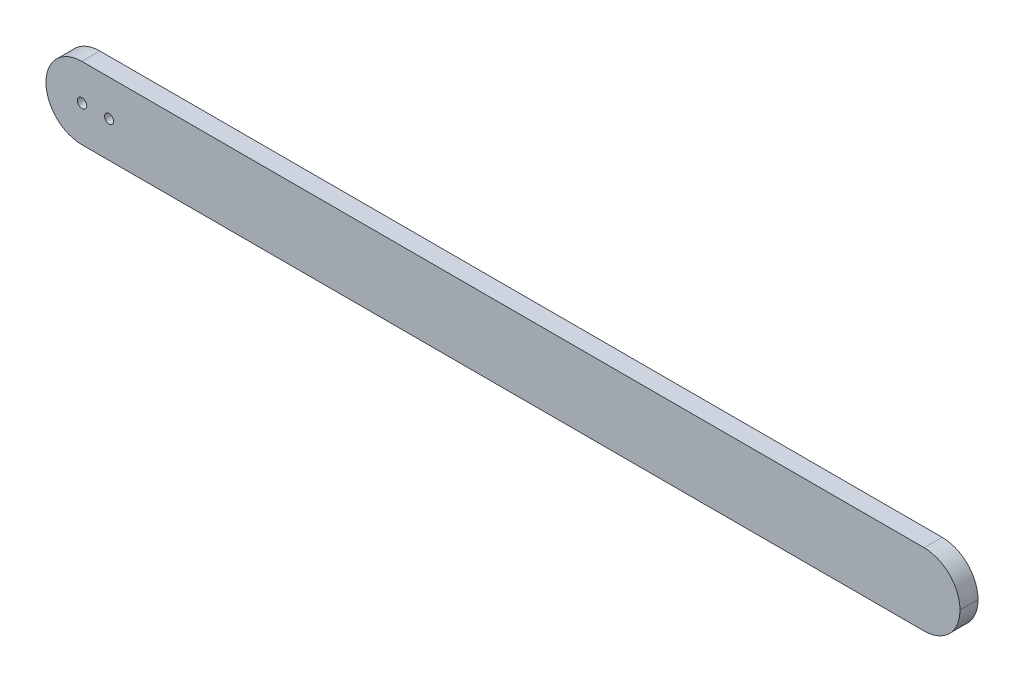
ISO-10303-21;
HEADER;
FILE_DESCRIPTION(('STEP AP214'),'2;1');
FILE_NAME('part.step','',(''),(''),'','','');
FILE_SCHEMA(('AUTOMOTIVE_DESIGN { 1 0 10303 214 1 1 1 1 }'));
ENDSEC;
DATA;
#1=APPLICATION_CONTEXT('core data for automotive mechanical design processes');
#2=APPLICATION_PROTOCOL_DEFINITION('international standard','automotive_design',2000,#1);
#3=PRODUCT_CONTEXT('',#1,'mechanical');
#4=PRODUCT('Part','Part','',(#3));
#5=PRODUCT_RELATED_PRODUCT_CATEGORY('part','',(#4));
#6=PRODUCT_DEFINITION_FORMATION('','',#4);
#7=PRODUCT_DEFINITION_CONTEXT('part definition',#1,'design');
#8=PRODUCT_DEFINITION('design','',#6,#7);
#9=PRODUCT_DEFINITION_SHAPE('','',#8);
#10=(LENGTH_UNIT() NAMED_UNIT(*) SI_UNIT(.MILLI.,.METRE.));
#11=(NAMED_UNIT(*) PLANE_ANGLE_UNIT() SI_UNIT($,.RADIAN.));
#12=(NAMED_UNIT(*) SI_UNIT($,.STERADIAN.) SOLID_ANGLE_UNIT());
#13=UNCERTAINTY_MEASURE_WITH_UNIT(LENGTH_MEASURE(1.E-05),#10,'distance_accuracy_value','');
#14=(GEOMETRIC_REPRESENTATION_CONTEXT(3) GLOBAL_UNCERTAINTY_ASSIGNED_CONTEXT((#13)) GLOBAL_UNIT_ASSIGNED_CONTEXT((#10,
#11,#12)) REPRESENTATION_CONTEXT('',''));
#15=CARTESIAN_POINT('',(0.,0.,0.));
#16=DIRECTION('',(0.,0.,1.));
#17=DIRECTION('',(1.,0.,0.));
#18=AXIS2_PLACEMENT_3D('',#15,#16,#17);
#19=CARTESIAN_POINT('',(927.354,-38.354,0.));
#20=DIRECTION('',(0.,0.,-1.));
#21=DIRECTION('',(-1.,0.,0.));
#22=AXIS2_PLACEMENT_3D('',#19,#20,#21);
#23=PLANE('',#22);
#24=CARTESIAN_POINT('',(38.1,-38.1,0.));
#25=DIRECTION('',(0.,0.,1.));
#26=DIRECTION('',(1.,0.,0.));
#27=AXIS2_PLACEMENT_3D('',#24,#25,#26);
#28=CIRCLE('',#27,4.96093750000001);
#29=CARTESIAN_POINT('',(43.0609375,-38.1,0.));
#30=VERTEX_POINT('',#29);
#31=EDGE_CURVE('E221',#30,#30,#28,.T.);
#32=ORIENTED_EDGE('',*,*,#31,.T.);
#33=EDGE_LOOP('',(#32));
#34=FACE_BOUND('',#33,.T.);
#35=CARTESIAN_POINT('',(603.25,-38.1000000000017,0.));
#36=DIRECTION('',(0.,0.,1.));
#37=DIRECTION('',(1.,0.,0.));
#38=AXIS2_PLACEMENT_3D('',#35,#36,#37);
#39=CIRCLE('',#38,16.66875);
#40=CARTESIAN_POINT('',(619.91875,-38.1000000000017,0.));
#41=VERTEX_POINT('',#40);
#42=EDGE_CURVE('E209',#41,#41,#39,.T.);
#43=ORIENTED_EDGE('',*,*,#42,.T.);
#44=EDGE_LOOP('',(#43));
#45=FACE_BOUND('',#44,.T.);
#46=CARTESIAN_POINT('',(844.55,-38.1,0.));
#47=DIRECTION('',(0.,0.,1.));
#48=DIRECTION('',(1.,0.,0.));
#49=AXIS2_PLACEMENT_3D('',#46,#47,#48);
#50=CIRCLE('',#49,16.66875);
#51=CARTESIAN_POINT('',(861.21875,-38.1,0.));
#52=VERTEX_POINT('',#51);
#53=EDGE_CURVE('E197',#52,#52,#50,.T.);
#54=ORIENTED_EDGE('',*,*,#53,.T.);
#55=EDGE_LOOP('',(#54));
#56=FACE_BOUND('',#55,.T.);
#57=CARTESIAN_POINT('',(241.3,-38.1000000000042,0.));
#58=DIRECTION('',(0.,0.,1.));
#59=DIRECTION('',(1.,0.,0.));
#60=AXIS2_PLACEMENT_3D('',#57,#58,#59);
#61=CIRCLE('',#60,16.66875);
#62=CARTESIAN_POINT('',(257.96875,-38.1000000000042,0.));
#63=VERTEX_POINT('',#62);
#64=EDGE_CURVE('E185',#63,#63,#61,.T.);
#65=ORIENTED_EDGE('',*,*,#64,.T.);
#66=EDGE_LOOP('',(#65));
#67=FACE_BOUND('',#66,.T.);
#68=CARTESIAN_POINT('',(927.354,-38.354,0.));
#69=DIRECTION('',(0.,0.,1.));
#70=DIRECTION('',(-1.,0.,0.));
#71=AXIS2_PLACEMENT_3D('',#68,#69,#70);
#72=CIRCLE('',#71,37.8460000000001);
#73=CARTESIAN_POINT('',(927.354,-76.2,0.));
#74=VERTEX_POINT('',#73);
#75=CARTESIAN_POINT('',(965.2,-38.354,0.));
#76=VERTEX_POINT('',#75);
#77=EDGE_CURVE('E131',#74,#76,#72,.T.);
#78=ORIENTED_EDGE('',*,*,#77,.F.);
#79=DIRECTION('',(1.,0.,0.));
#80=VECTOR('',#79,1.);
#81=CARTESIAN_POINT('',(37.846,-76.2,0.));
#82=LINE('',#81,#80);
#83=CARTESIAN_POINT('',(37.846,-76.2,0.));
#84=VERTEX_POINT('',#83);
#85=EDGE_CURVE('E85',#84,#74,#82,.T.);
#86=ORIENTED_EDGE('',*,*,#85,.F.);
#87=CARTESIAN_POINT('',(37.846,-38.354,0.));
#88=DIRECTION('',(0.,0.,1.));
#89=DIRECTION('',(1.,0.,0.));
#90=AXIS2_PLACEMENT_3D('',#87,#88,#89);
#91=CIRCLE('',#90,37.846);
#92=CARTESIAN_POINT('',(0.,-38.354,0.));
#93=VERTEX_POINT('',#92);
#94=EDGE_CURVE('E79',#93,#84,#91,.T.);
#95=ORIENTED_EDGE('',*,*,#94,.F.);
#96=DIRECTION('',(0.,-1.,0.));
#97=VECTOR('',#96,1.);
#98=CARTESIAN_POINT('',(0.,-37.846,0.));
#99=LINE('',#98,#97);
#100=CARTESIAN_POINT('',(0.,-37.846,0.));
#101=VERTEX_POINT('',#100);
#102=EDGE_CURVE('E121',#101,#93,#99,.T.);
#103=ORIENTED_EDGE('',*,*,#102,.F.);
#104=CARTESIAN_POINT('',(37.846,-37.846,0.));
#105=DIRECTION('',(0.,0.,1.));
#106=DIRECTION('',(-1.,0.,0.));
#107=AXIS2_PLACEMENT_3D('',#104,#105,#106);
#108=CIRCLE('',#107,37.846);
#109=CARTESIAN_POINT('',(37.846,0.,0.));
#110=VERTEX_POINT('',#109);
#111=EDGE_CURVE('E141',#110,#101,#108,.T.);
#112=ORIENTED_EDGE('',*,*,#111,.F.);
#113=DIRECTION('',(-1.,0.,0.));
#114=VECTOR('',#113,1.);
#115=CARTESIAN_POINT('',(37.846,0.,0.));
#116=LINE('',#115,#114);
#117=CARTESIAN_POINT('',(927.354,0.,0.));
#118=VERTEX_POINT('',#117);
#119=EDGE_CURVE('E139',#118,#110,#116,.T.);
#120=ORIENTED_EDGE('',*,*,#119,.F.);
#121=CARTESIAN_POINT('',(927.354,-37.846,0.));
#122=DIRECTION('',(0.,0.,1.));
#123=DIRECTION('',(1.,0.,0.));
#124=AXIS2_PLACEMENT_3D('',#121,#122,#123);
#125=CIRCLE('',#124,37.8460000000001);
#126=CARTESIAN_POINT('',(965.2,-37.846,0.));
#127=VERTEX_POINT('',#126);
#128=EDGE_CURVE('E137',#127,#118,#125,.T.);
#129=ORIENTED_EDGE('',*,*,#128,.F.);
#130=DIRECTION('',(0.,1.,0.));
#131=VECTOR('',#130,1.);
#132=CARTESIAN_POINT('',(965.2,-37.846,0.));
#133=LINE('',#132,#131);
#134=EDGE_CURVE('E134',#76,#127,#133,.T.);
#135=ORIENTED_EDGE('',*,*,#134,.F.);
#136=EDGE_LOOP('',(#78,#86,#95,#103,#112,#120,#129,#135));
#137=FACE_BOUND('',#136,.T.);
#138=CARTESIAN_POINT('',(120.65,-38.1000000000051,0.));
#139=DIRECTION('',(0.,0.,1.));
#140=DIRECTION('',(1.,0.,0.));
#141=AXIS2_PLACEMENT_3D('',#138,#139,#140);
#142=CIRCLE('',#141,16.66875);
#143=CARTESIAN_POINT('',(137.31875,-38.1000000000051,0.));
#144=VERTEX_POINT('',#143);
#145=EDGE_CURVE('E179',#144,#144,#142,.T.);
#146=ORIENTED_EDGE('',*,*,#145,.T.);
#147=EDGE_LOOP('',(#146));
#148=FACE_BOUND('',#147,.T.);
#149=CARTESIAN_POINT('',(361.95,-38.1000000000034,0.));
#150=DIRECTION('',(0.,0.,1.));
#151=DIRECTION('',(1.,0.,0.));
#152=AXIS2_PLACEMENT_3D('',#149,#150,#151);
#153=CIRCLE('',#152,16.66875);
#154=CARTESIAN_POINT('',(378.61875,-38.1000000000034,0.));
#155=VERTEX_POINT('',#154);
#156=EDGE_CURVE('E191',#155,#155,#153,.T.);
#157=ORIENTED_EDGE('',*,*,#156,.T.);
#158=EDGE_LOOP('',(#157));
#159=FACE_BOUND('',#158,.T.);
#160=CARTESIAN_POINT('',(723.9,-38.1000000000008,0.));
#161=DIRECTION('',(0.,0.,1.));
#162=DIRECTION('',(1.,0.,0.));
#163=AXIS2_PLACEMENT_3D('',#160,#161,#162);
#164=CIRCLE('',#163,16.66875);
#165=CARTESIAN_POINT('',(740.56875,-38.1000000000008,0.));
#166=VERTEX_POINT('',#165);
#167=EDGE_CURVE('E203',#166,#166,#164,.T.);
#168=ORIENTED_EDGE('',*,*,#167,.T.);
#169=EDGE_LOOP('',(#168));
#170=FACE_BOUND('',#169,.T.);
#171=CARTESIAN_POINT('',(482.6,-38.1000000000025,0.));
#172=DIRECTION('',(0.,0.,1.));
#173=DIRECTION('',(1.,0.,0.));
#174=AXIS2_PLACEMENT_3D('',#171,#172,#173);
#175=CIRCLE('',#174,16.66875);
#176=CARTESIAN_POINT('',(499.26875,-38.1000000000025,0.));
#177=VERTEX_POINT('',#176);
#178=EDGE_CURVE('E215',#177,#177,#175,.T.);
#179=ORIENTED_EDGE('',*,*,#178,.T.);
#180=EDGE_LOOP('',(#179));
#181=FACE_BOUND('',#180,.T.);
#182=CARTESIAN_POINT('',(66.675,-38.1,0.));
#183=DIRECTION('',(0.,0.,1.));
#184=DIRECTION('',(1.,0.,0.));
#185=AXIS2_PLACEMENT_3D('',#182,#183,#184);
#186=CIRCLE('',#185,4.7625);
#187=CARTESIAN_POINT('',(71.4375,-38.1,0.));
#188=VERTEX_POINT('',#187);
#189=EDGE_CURVE('E227',#188,#188,#186,.T.);
#190=ORIENTED_EDGE('',*,*,#189,.T.);
#191=EDGE_LOOP('',(#190));
#192=FACE_BOUND('',#191,.T.);
#193=ADVANCED_FACE('F33',(#34,#45,#56,#67,#137,#148,#159,#170,#181,#192),#23,.T.);
#194=CARTESIAN_POINT('',(927.354,-38.354,19.05));
#195=DIRECTION('',(0.,0.,-1.));
#196=DIRECTION('',(-1.,0.,0.));
#197=AXIS2_PLACEMENT_3D('',#194,#195,#196);
#198=PLANE('',#197);
#199=CARTESIAN_POINT('',(38.1,-38.1,19.05));
#200=DIRECTION('',(0.,0.,1.));
#201=DIRECTION('',(1.,0.,0.));
#202=AXIS2_PLACEMENT_3D('',#199,#200,#201);
#203=CIRCLE('',#202,4.96093750000001);
#204=CARTESIAN_POINT('',(43.0609375,-38.1,19.05));
#205=VERTEX_POINT('',#204);
#206=EDGE_CURVE('E218',#205,#205,#203,.T.);
#207=ORIENTED_EDGE('',*,*,#206,.F.);
#208=EDGE_LOOP('',(#207));
#209=FACE_BOUND('',#208,.T.);
#210=CARTESIAN_POINT('',(927.354,-38.354,19.05));
#211=DIRECTION('',(0.,0.,1.));
#212=DIRECTION('',(-1.,0.,0.));
#213=AXIS2_PLACEMENT_3D('',#210,#211,#212);
#214=CIRCLE('',#213,37.8460000000001);
#215=CARTESIAN_POINT('',(927.354,-76.2,19.05));
#216=VERTEX_POINT('',#215);
#217=CARTESIAN_POINT('',(965.2,-38.354,19.05));
#218=VERTEX_POINT('',#217);
#219=EDGE_CURVE('E146',#216,#218,#214,.T.);
#220=ORIENTED_EDGE('',*,*,#219,.T.);
#221=DIRECTION('',(0.,1.,0.));
#222=VECTOR('',#221,1.);
#223=CARTESIAN_POINT('',(965.2,-37.846,19.05));
#224=LINE('',#223,#222);
#225=CARTESIAN_POINT('',(965.2,-37.846,19.05));
#226=VERTEX_POINT('',#225);
#227=EDGE_CURVE('E93',#218,#226,#224,.T.);
#228=ORIENTED_EDGE('',*,*,#227,.T.);
#229=CARTESIAN_POINT('',(927.354,-37.846,19.05));
#230=DIRECTION('',(0.,0.,1.));
#231=DIRECTION('',(1.,0.,0.));
#232=AXIS2_PLACEMENT_3D('',#229,#230,#231);
#233=CIRCLE('',#232,37.8460000000001);
#234=CARTESIAN_POINT('',(927.354,0.,19.05));
#235=VERTEX_POINT('',#234);
#236=EDGE_CURVE('E161',#226,#235,#233,.T.);
#237=ORIENTED_EDGE('',*,*,#236,.T.);
#238=DIRECTION('',(-1.,0.,0.));
#239=VECTOR('',#238,1.);
#240=CARTESIAN_POINT('',(37.846,0.,19.05));
#241=LINE('',#240,#239);
#242=CARTESIAN_POINT('',(37.846,0.,19.05));
#243=VERTEX_POINT('',#242);
#244=EDGE_CURVE('E173',#235,#243,#241,.T.);
#245=ORIENTED_EDGE('',*,*,#244,.T.);
#246=CARTESIAN_POINT('',(37.846,-37.846,19.05));
#247=DIRECTION('',(0.,0.,1.));
#248=DIRECTION('',(-1.,0.,0.));
#249=AXIS2_PLACEMENT_3D('',#246,#247,#248);
#250=CIRCLE('',#249,37.846);
#251=CARTESIAN_POINT('',(0.,-37.846,19.05));
#252=VERTEX_POINT('',#251);
#253=EDGE_CURVE('E113',#243,#252,#250,.T.);
#254=ORIENTED_EDGE('',*,*,#253,.T.);
#255=DIRECTION('',(0.,-1.,0.));
#256=VECTOR('',#255,1.);
#257=CARTESIAN_POINT('',(0.,-37.846,19.05));
#258=LINE('',#257,#256);
#259=CARTESIAN_POINT('',(0.,-38.354,19.05));
#260=VERTEX_POINT('',#259);
#261=EDGE_CURVE('E106',#252,#260,#258,.T.);
#262=ORIENTED_EDGE('',*,*,#261,.T.);
#263=CARTESIAN_POINT('',(37.846,-38.354,19.05));
#264=DIRECTION('',(0.,0.,1.));
#265=DIRECTION('',(1.,0.,0.));
#266=AXIS2_PLACEMENT_3D('',#263,#264,#265);
#267=CIRCLE('',#266,37.846);
#268=CARTESIAN_POINT('',(37.846,-76.2,19.05));
#269=VERTEX_POINT('',#268);
#270=EDGE_CURVE('E111',#260,#269,#267,.T.);
#271=ORIENTED_EDGE('',*,*,#270,.T.);
#272=DIRECTION('',(1.,0.,0.));
#273=VECTOR('',#272,1.);
#274=CARTESIAN_POINT('',(37.846,-76.2,19.05));
#275=LINE('',#274,#273);
#276=EDGE_CURVE('E50',#269,#216,#275,.T.);
#277=ORIENTED_EDGE('',*,*,#276,.T.);
#278=EDGE_LOOP('',(#220,#228,#237,#245,#254,#262,#271,#277));
#279=FACE_BOUND('',#278,.T.);
#280=CARTESIAN_POINT('',(66.675,-38.1,19.05));
#281=DIRECTION('',(0.,0.,1.));
#282=DIRECTION('',(1.,0.,0.));
#283=AXIS2_PLACEMENT_3D('',#280,#281,#282);
#284=CIRCLE('',#283,4.7625);
#285=CARTESIAN_POINT('',(71.4375,-38.1,19.05));
#286=VERTEX_POINT('',#285);
#287=EDGE_CURVE('E224',#286,#286,#284,.T.);
#288=ORIENTED_EDGE('',*,*,#287,.F.);
#289=EDGE_LOOP('',(#288));
#290=FACE_BOUND('',#289,.T.);
#291=ADVANCED_FACE('F108',(#209,#279,#290),#198,.F.);
#292=CARTESIAN_POINT('',(927.354,-38.354,19.05));
#293=DIRECTION('',(0.,0.,-1.));
#294=DIRECTION('',(-1.,0.,0.));
#295=AXIS2_PLACEMENT_3D('',#292,#293,#294);
#296=CYLINDRICAL_SURFACE('',#295,37.8460000000001);
#297=ORIENTED_EDGE('',*,*,#77,.T.);
#298=DIRECTION('',(0.,0.,-1.));
#299=VECTOR('',#298,1.);
#300=CARTESIAN_POINT('',(965.2,-38.354,19.05));
#301=LINE('',#300,#299);
#302=EDGE_CURVE('E11',#218,#76,#301,.T.);
#303=ORIENTED_EDGE('',*,*,#302,.F.);
#304=ORIENTED_EDGE('',*,*,#219,.F.);
#305=DIRECTION('',(0.,0.,-1.));
#306=VECTOR('',#305,1.);
#307=CARTESIAN_POINT('',(927.354,-76.2,19.05));
#308=LINE('',#307,#306);
#309=EDGE_CURVE('E127',#216,#74,#308,.T.);
#310=ORIENTED_EDGE('',*,*,#309,.T.);
#311=EDGE_LOOP('',(#297,#303,#304,#310));
#312=FACE_BOUND('',#311,.T.);
#313=ADVANCED_FACE('F35',(#312),#296,.T.);
#314=CARTESIAN_POINT('',(965.2,-37.846,19.05));
#315=DIRECTION('',(-1.,0.,0.));
#316=DIRECTION('',(0.,0.,1.));
#317=AXIS2_PLACEMENT_3D('',#314,#315,#316);
#318=PLANE('',#317);
#319=ORIENTED_EDGE('',*,*,#134,.T.);
#320=DIRECTION('',(0.,0.,-1.));
#321=VECTOR('',#320,1.);
#322=CARTESIAN_POINT('',(965.2,-37.846,19.05));
#323=LINE('',#322,#321);
#324=EDGE_CURVE('E42',#226,#127,#323,.T.);
#325=ORIENTED_EDGE('',*,*,#324,.F.);
#326=ORIENTED_EDGE('',*,*,#227,.F.);
#327=ORIENTED_EDGE('',*,*,#302,.T.);
#328=EDGE_LOOP('',(#319,#325,#326,#327));
#329=FACE_BOUND('',#328,.T.);
#330=ADVANCED_FACE('F242',(#329),#318,.F.);
#331=CARTESIAN_POINT('',(927.354,-37.846,19.05));
#332=DIRECTION('',(0.,0.,-1.));
#333=DIRECTION('',(-1.,0.,0.));
#334=AXIS2_PLACEMENT_3D('',#331,#332,#333);
#335=CYLINDRICAL_SURFACE('',#334,37.8460000000001);
#336=ORIENTED_EDGE('',*,*,#128,.T.);
#337=DIRECTION('',(0.,0.,-1.));
#338=VECTOR('',#337,1.);
#339=CARTESIAN_POINT('',(927.354,0.,19.05));
#340=LINE('',#339,#338);
#341=EDGE_CURVE('E153',#235,#118,#340,.T.);
#342=ORIENTED_EDGE('',*,*,#341,.F.);
#343=ORIENTED_EDGE('',*,*,#236,.F.);
#344=ORIENTED_EDGE('',*,*,#324,.T.);
#345=EDGE_LOOP('',(#336,#342,#343,#344));
#346=FACE_BOUND('',#345,.T.);
#347=ADVANCED_FACE('F159',(#346),#335,.T.);
#348=CARTESIAN_POINT('',(37.846,0.,19.05));
#349=DIRECTION('',(0.,-1.,0.));
#350=DIRECTION('',(0.,0.,-1.));
#351=AXIS2_PLACEMENT_3D('',#348,#349,#350);
#352=PLANE('',#351);
#353=ORIENTED_EDGE('',*,*,#119,.T.);
#354=DIRECTION('',(0.,0.,-1.));
#355=VECTOR('',#354,1.);
#356=CARTESIAN_POINT('',(37.846,0.,19.05));
#357=LINE('',#356,#355);
#358=EDGE_CURVE('E150',#243,#110,#357,.T.);
#359=ORIENTED_EDGE('',*,*,#358,.F.);
#360=ORIENTED_EDGE('',*,*,#244,.F.);
#361=ORIENTED_EDGE('',*,*,#341,.T.);
#362=EDGE_LOOP('',(#353,#359,#360,#361));
#363=FACE_BOUND('',#362,.T.);
#364=ADVANCED_FACE('F169',(#363),#352,.F.);
#365=CARTESIAN_POINT('',(37.846,-37.846,19.05));
#366=DIRECTION('',(0.,0.,-1.));
#367=DIRECTION('',(-1.,0.,0.));
#368=AXIS2_PLACEMENT_3D('',#365,#366,#367);
#369=CYLINDRICAL_SURFACE('',#368,37.846);
#370=ORIENTED_EDGE('',*,*,#111,.T.);
#371=DIRECTION('',(0.,0.,-1.));
#372=VECTOR('',#371,1.);
#373=CARTESIAN_POINT('',(0.,-37.846,19.05));
#374=LINE('',#373,#372);
#375=EDGE_CURVE('E122',#252,#101,#374,.T.);
#376=ORIENTED_EDGE('',*,*,#375,.F.);
#377=ORIENTED_EDGE('',*,*,#253,.F.);
#378=ORIENTED_EDGE('',*,*,#358,.T.);
#379=EDGE_LOOP('',(#370,#376,#377,#378));
#380=FACE_BOUND('',#379,.T.);
#381=ADVANCED_FACE('F172',(#380),#369,.T.);
#382=CARTESIAN_POINT('',(0.,-37.846,19.05));
#383=DIRECTION('',(1.,0.,0.));
#384=DIRECTION('',(0.,0.,-1.));
#385=AXIS2_PLACEMENT_3D('',#382,#383,#384);
#386=PLANE('',#385);
#387=ORIENTED_EDGE('',*,*,#102,.T.);
#388=DIRECTION('',(0.,0.,-1.));
#389=VECTOR('',#388,1.);
#390=CARTESIAN_POINT('',(0.,-38.354,19.05));
#391=LINE('',#390,#389);
#392=EDGE_CURVE('E118',#260,#93,#391,.T.);
#393=ORIENTED_EDGE('',*,*,#392,.F.);
#394=ORIENTED_EDGE('',*,*,#261,.F.);
#395=ORIENTED_EDGE('',*,*,#375,.T.);
#396=EDGE_LOOP('',(#387,#393,#394,#395));
#397=FACE_BOUND('',#396,.T.);
#398=ADVANCED_FACE('F119',(#397),#386,.F.);
#399=CARTESIAN_POINT('',(37.846,-38.354,19.05));
#400=DIRECTION('',(0.,0.,-1.));
#401=DIRECTION('',(-1.,0.,0.));
#402=AXIS2_PLACEMENT_3D('',#399,#400,#401);
#403=CYLINDRICAL_SURFACE('',#402,37.846);
#404=ORIENTED_EDGE('',*,*,#94,.T.);
#405=DIRECTION('',(0.,0.,-1.));
#406=VECTOR('',#405,1.);
#407=CARTESIAN_POINT('',(37.846,-76.2,19.05));
#408=LINE('',#407,#406);
#409=EDGE_CURVE('E123',#269,#84,#408,.T.);
#410=ORIENTED_EDGE('',*,*,#409,.F.);
#411=ORIENTED_EDGE('',*,*,#270,.F.);
#412=ORIENTED_EDGE('',*,*,#392,.T.);
#413=EDGE_LOOP('',(#404,#410,#411,#412));
#414=FACE_BOUND('',#413,.T.);
#415=ADVANCED_FACE('F125',(#414),#403,.T.);
#416=CARTESIAN_POINT('',(37.846,-76.2,19.05));
#417=DIRECTION('',(0.,1.,0.));
#418=DIRECTION('',(-1.,0.,0.));
#419=AXIS2_PLACEMENT_3D('',#416,#417,#418);
#420=PLANE('',#419);
#421=ORIENTED_EDGE('',*,*,#85,.T.);
#422=ORIENTED_EDGE('',*,*,#309,.F.);
#423=ORIENTED_EDGE('',*,*,#276,.F.);
#424=ORIENTED_EDGE('',*,*,#409,.T.);
#425=EDGE_LOOP('',(#421,#422,#423,#424));
#426=FACE_BOUND('',#425,.T.);
#427=ADVANCED_FACE('F251',(#426),#420,.F.);
#428=CARTESIAN_POINT('',(120.65,-38.1000000000051,9.525));
#429=DIRECTION('',(0.,0.,-1.));
#430=DIRECTION('',(-1.,0.,0.));
#431=AXIS2_PLACEMENT_3D('',#428,#429,#430);
#432=CYLINDRICAL_SURFACE('',#431,16.66875);
#433=CARTESIAN_POINT('',(120.65,-38.1000000000051,9.525));
#434=DIRECTION('',(0.,0.,1.));
#435=DIRECTION('',(1.,0.,0.));
#436=AXIS2_PLACEMENT_3D('',#433,#434,#435);
#437=CIRCLE('',#436,16.66875);
#438=CARTESIAN_POINT('',(137.31875,-38.1000000000051,9.525));
#439=VERTEX_POINT('',#438);
#440=EDGE_CURVE('E135',#439,#439,#437,.T.);
#441=ORIENTED_EDGE('',*,*,#440,.T.);
#442=EDGE_LOOP('',(#441));
#443=FACE_BOUND('',#442,.T.);
#444=ORIENTED_EDGE('',*,*,#145,.F.);
#445=EDGE_LOOP('',(#444));
#446=FACE_BOUND('',#445,.T.);
#447=ADVANCED_FACE('F248',(#443,#446),#432,.F.);
#448=CARTESIAN_POINT('',(0.,0.,9.525));
#449=DIRECTION('',(0.,0.,1.));
#450=DIRECTION('',(1.,0.,0.));
#451=AXIS2_PLACEMENT_3D('',#448,#449,#450);
#452=PLANE('',#451);
#453=ORIENTED_EDGE('',*,*,#440,.F.);
#454=EDGE_LOOP('',(#453));
#455=FACE_BOUND('',#454,.T.);
#456=ADVANCED_FACE('F300',(#455),#452,.F.);
#457=CARTESIAN_POINT('',(241.3,-38.1000000000042,9.525));
#458=DIRECTION('',(0.,0.,-1.));
#459=DIRECTION('',(-1.,0.,0.));
#460=AXIS2_PLACEMENT_3D('',#457,#458,#459);
#461=CYLINDRICAL_SURFACE('',#460,16.66875);
#462=CARTESIAN_POINT('',(241.3,-38.1000000000042,9.525));
#463=DIRECTION('',(0.,0.,1.));
#464=DIRECTION('',(1.,0.,0.));
#465=AXIS2_PLACEMENT_3D('',#462,#463,#464);
#466=CIRCLE('',#465,16.66875);
#467=CARTESIAN_POINT('',(257.96875,-38.1000000000042,9.525));
#468=VERTEX_POINT('',#467);
#469=EDGE_CURVE('E182',#468,#468,#466,.T.);
#470=ORIENTED_EDGE('',*,*,#469,.T.);
#471=EDGE_LOOP('',(#470));
#472=FACE_BOUND('',#471,.T.);
#473=ORIENTED_EDGE('',*,*,#64,.F.);
#474=EDGE_LOOP('',(#473));
#475=FACE_BOUND('',#474,.T.);
#476=ADVANCED_FACE('F307',(#472,#475),#461,.F.);
#477=CARTESIAN_POINT('',(0.,0.,9.525));
#478=DIRECTION('',(0.,0.,1.));
#479=DIRECTION('',(1.,0.,0.));
#480=AXIS2_PLACEMENT_3D('',#477,#478,#479);
#481=PLANE('',#480);
#482=ORIENTED_EDGE('',*,*,#469,.F.);
#483=EDGE_LOOP('',(#482));
#484=FACE_BOUND('',#483,.T.);
#485=ADVANCED_FACE('F314',(#484),#481,.F.);
#486=CARTESIAN_POINT('',(361.95,-38.1000000000034,9.525));
#487=DIRECTION('',(0.,0.,-1.));
#488=DIRECTION('',(-1.,0.,0.));
#489=AXIS2_PLACEMENT_3D('',#486,#487,#488);
#490=CYLINDRICAL_SURFACE('',#489,16.66875);
#491=CARTESIAN_POINT('',(361.95,-38.1000000000034,9.525));
#492=DIRECTION('',(0.,0.,1.));
#493=DIRECTION('',(1.,0.,0.));
#494=AXIS2_PLACEMENT_3D('',#491,#492,#493);
#495=CIRCLE('',#494,16.66875);
#496=CARTESIAN_POINT('',(378.61875,-38.1000000000034,9.525));
#497=VERTEX_POINT('',#496);
#498=EDGE_CURVE('E188',#497,#497,#495,.T.);
#499=ORIENTED_EDGE('',*,*,#498,.T.);
#500=EDGE_LOOP('',(#499));
#501=FACE_BOUND('',#500,.T.);
#502=ORIENTED_EDGE('',*,*,#156,.F.);
#503=EDGE_LOOP('',(#502));
#504=FACE_BOUND('',#503,.T.);
#505=ADVANCED_FACE('F322',(#501,#504),#490,.F.);
#506=CARTESIAN_POINT('',(0.,0.,9.525));
#507=DIRECTION('',(0.,0.,1.));
#508=DIRECTION('',(1.,0.,0.));
#509=AXIS2_PLACEMENT_3D('',#506,#507,#508);
#510=PLANE('',#509);
#511=ORIENTED_EDGE('',*,*,#498,.F.);
#512=EDGE_LOOP('',(#511));
#513=FACE_BOUND('',#512,.T.);
#514=ADVANCED_FACE('F330',(#513),#510,.F.);
#515=CARTESIAN_POINT('',(844.55,-38.1,9.525));
#516=DIRECTION('',(0.,0.,-1.));
#517=DIRECTION('',(-1.,0.,0.));
#518=AXIS2_PLACEMENT_3D('',#515,#516,#517);
#519=CYLINDRICAL_SURFACE('',#518,16.66875);
#520=CARTESIAN_POINT('',(844.55,-38.1,9.525));
#521=DIRECTION('',(0.,0.,1.));
#522=DIRECTION('',(1.,0.,0.));
#523=AXIS2_PLACEMENT_3D('',#520,#521,#522);
#524=CIRCLE('',#523,16.66875);
#525=CARTESIAN_POINT('',(861.21875,-38.1,9.525));
#526=VERTEX_POINT('',#525);
#527=EDGE_CURVE('E194',#526,#526,#524,.T.);
#528=ORIENTED_EDGE('',*,*,#527,.T.);
#529=EDGE_LOOP('',(#528));
#530=FACE_BOUND('',#529,.T.);
#531=ORIENTED_EDGE('',*,*,#53,.F.);
#532=EDGE_LOOP('',(#531));
#533=FACE_BOUND('',#532,.T.);
#534=ADVANCED_FACE('F338',(#530,#533),#519,.F.);
#535=CARTESIAN_POINT('',(0.,0.,9.525));
#536=DIRECTION('',(0.,0.,1.));
#537=DIRECTION('',(1.,0.,0.));
#538=AXIS2_PLACEMENT_3D('',#535,#536,#537);
#539=PLANE('',#538);
#540=ORIENTED_EDGE('',*,*,#527,.F.);
#541=EDGE_LOOP('',(#540));
#542=FACE_BOUND('',#541,.T.);
#543=ADVANCED_FACE('F346',(#542),#539,.F.);
#544=CARTESIAN_POINT('',(723.9,-38.1000000000008,9.525));
#545=DIRECTION('',(0.,0.,-1.));
#546=DIRECTION('',(-1.,0.,0.));
#547=AXIS2_PLACEMENT_3D('',#544,#545,#546);
#548=CYLINDRICAL_SURFACE('',#547,16.66875);
#549=CARTESIAN_POINT('',(723.9,-38.1000000000008,9.525));
#550=DIRECTION('',(0.,0.,1.));
#551=DIRECTION('',(1.,0.,0.));
#552=AXIS2_PLACEMENT_3D('',#549,#550,#551);
#553=CIRCLE('',#552,16.66875);
#554=CARTESIAN_POINT('',(740.56875,-38.1000000000008,9.525));
#555=VERTEX_POINT('',#554);
#556=EDGE_CURVE('E200',#555,#555,#553,.T.);
#557=ORIENTED_EDGE('',*,*,#556,.T.);
#558=EDGE_LOOP('',(#557));
#559=FACE_BOUND('',#558,.T.);
#560=ORIENTED_EDGE('',*,*,#167,.F.);
#561=EDGE_LOOP('',(#560));
#562=FACE_BOUND('',#561,.T.);
#563=ADVANCED_FACE('F354',(#559,#562),#548,.F.);
#564=CARTESIAN_POINT('',(0.,0.,9.525));
#565=DIRECTION('',(0.,0.,1.));
#566=DIRECTION('',(1.,0.,0.));
#567=AXIS2_PLACEMENT_3D('',#564,#565,#566);
#568=PLANE('',#567);
#569=ORIENTED_EDGE('',*,*,#556,.F.);
#570=EDGE_LOOP('',(#569));
#571=FACE_BOUND('',#570,.T.);
#572=ADVANCED_FACE('F362',(#571),#568,.F.);
#573=CARTESIAN_POINT('',(603.25,-38.1000000000017,9.525));
#574=DIRECTION('',(0.,0.,-1.));
#575=DIRECTION('',(-1.,0.,0.));
#576=AXIS2_PLACEMENT_3D('',#573,#574,#575);
#577=CYLINDRICAL_SURFACE('',#576,16.66875);
#578=CARTESIAN_POINT('',(603.25,-38.1000000000017,9.525));
#579=DIRECTION('',(0.,0.,1.));
#580=DIRECTION('',(1.,0.,0.));
#581=AXIS2_PLACEMENT_3D('',#578,#579,#580);
#582=CIRCLE('',#581,16.66875);
#583=CARTESIAN_POINT('',(619.91875,-38.1000000000017,9.525));
#584=VERTEX_POINT('',#583);
#585=EDGE_CURVE('E206',#584,#584,#582,.T.);
#586=ORIENTED_EDGE('',*,*,#585,.T.);
#587=EDGE_LOOP('',(#586));
#588=FACE_BOUND('',#587,.T.);
#589=ORIENTED_EDGE('',*,*,#42,.F.);
#590=EDGE_LOOP('',(#589));
#591=FACE_BOUND('',#590,.T.);
#592=ADVANCED_FACE('F370',(#588,#591),#577,.F.);
#593=CARTESIAN_POINT('',(0.,0.,9.525));
#594=DIRECTION('',(0.,0.,1.));
#595=DIRECTION('',(1.,0.,0.));
#596=AXIS2_PLACEMENT_3D('',#593,#594,#595);
#597=PLANE('',#596);
#598=ORIENTED_EDGE('',*,*,#585,.F.);
#599=EDGE_LOOP('',(#598));
#600=FACE_BOUND('',#599,.T.);
#601=ADVANCED_FACE('F378',(#600),#597,.F.);
#602=CARTESIAN_POINT('',(482.6,-38.1000000000025,9.525));
#603=DIRECTION('',(0.,0.,-1.));
#604=DIRECTION('',(-1.,0.,0.));
#605=AXIS2_PLACEMENT_3D('',#602,#603,#604);
#606=CYLINDRICAL_SURFACE('',#605,16.66875);
#607=CARTESIAN_POINT('',(482.6,-38.1000000000025,9.525));
#608=DIRECTION('',(0.,0.,1.));
#609=DIRECTION('',(1.,0.,0.));
#610=AXIS2_PLACEMENT_3D('',#607,#608,#609);
#611=CIRCLE('',#610,16.66875);
#612=CARTESIAN_POINT('',(499.26875,-38.1000000000025,9.525));
#613=VERTEX_POINT('',#612);
#614=EDGE_CURVE('E212',#613,#613,#611,.T.);
#615=ORIENTED_EDGE('',*,*,#614,.T.);
#616=EDGE_LOOP('',(#615));
#617=FACE_BOUND('',#616,.T.);
#618=ORIENTED_EDGE('',*,*,#178,.F.);
#619=EDGE_LOOP('',(#618));
#620=FACE_BOUND('',#619,.T.);
#621=ADVANCED_FACE('F386',(#617,#620),#606,.F.);
#622=CARTESIAN_POINT('',(0.,0.,9.525));
#623=DIRECTION('',(0.,0.,1.));
#624=DIRECTION('',(1.,0.,0.));
#625=AXIS2_PLACEMENT_3D('',#622,#623,#624);
#626=PLANE('',#625);
#627=ORIENTED_EDGE('',*,*,#614,.F.);
#628=EDGE_LOOP('',(#627));
#629=FACE_BOUND('',#628,.T.);
#630=ADVANCED_FACE('F394',(#629),#626,.F.);
#631=CARTESIAN_POINT('',(38.1,-38.1,19.05));
#632=DIRECTION('',(0.,0.,-1.));
#633=DIRECTION('',(-1.,0.,0.));
#634=AXIS2_PLACEMENT_3D('',#631,#632,#633);
#635=CYLINDRICAL_SURFACE('',#634,4.96093750000001);
#636=ORIENTED_EDGE('',*,*,#206,.T.);
#637=EDGE_LOOP('',(#636));
#638=FACE_BOUND('',#637,.T.);
#639=ORIENTED_EDGE('',*,*,#31,.F.);
#640=EDGE_LOOP('',(#639));
#641=FACE_BOUND('',#640,.T.);
#642=ADVANCED_FACE('F402',(#638,#641),#635,.F.);
#643=CARTESIAN_POINT('',(66.675,-38.1,19.05));
#644=DIRECTION('',(0.,0.,-1.));
#645=DIRECTION('',(-1.,0.,0.));
#646=AXIS2_PLACEMENT_3D('',#643,#644,#645);
#647=CYLINDRICAL_SURFACE('',#646,4.7625);
#648=ORIENTED_EDGE('',*,*,#287,.T.);
#649=EDGE_LOOP('',(#648));
#650=FACE_BOUND('',#649,.T.);
#651=ORIENTED_EDGE('',*,*,#189,.F.);
#652=EDGE_LOOP('',(#651));
#653=FACE_BOUND('',#652,.T.);
#654=ADVANCED_FACE('F233',(#650,#653),#647,.F.);
#655=CLOSED_SHELL('',(#193,#291,#313,#330,#347,#364,#381,#398,#415,#427,#447,#456,#476,#485,
#505,#514,#534,#543,#563,#572,#592,#601,#621,#630,#642,#654));
#656=MANIFOLD_SOLID_BREP('B2',#655);
#657=ADVANCED_BREP_SHAPE_REPRESENTATION('',(#18,#656),#14);
#658=SHAPE_DEFINITION_REPRESENTATION(#9,#657);
ENDSEC;
END-ISO-10303-21;
